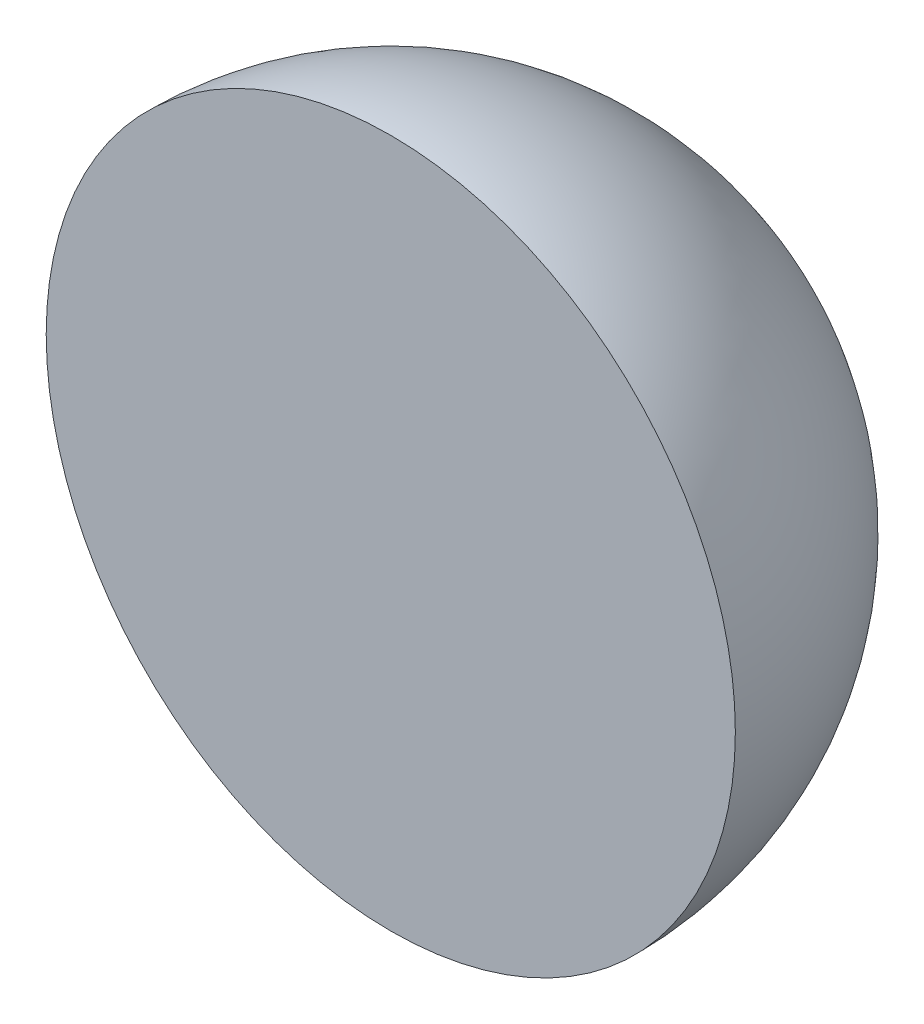
ISO-10303-21;
HEADER;
FILE_DESCRIPTION(('STEP AP214'),'2;1');
FILE_NAME('part.step','',(''),(''),'','','');
FILE_SCHEMA(('AUTOMOTIVE_DESIGN { 1 0 10303 214 1 1 1 1 }'));
ENDSEC;
DATA;
#1=APPLICATION_CONTEXT('core data for automotive mechanical design processes');
#2=APPLICATION_PROTOCOL_DEFINITION('international standard','automotive_design',2000,#1);
#3=PRODUCT_CONTEXT('',#1,'mechanical');
#4=PRODUCT('Part','Part','',(#3));
#5=PRODUCT_RELATED_PRODUCT_CATEGORY('part','',(#4));
#6=PRODUCT_DEFINITION_FORMATION('','',#4);
#7=PRODUCT_DEFINITION_CONTEXT('part definition',#1,'design');
#8=PRODUCT_DEFINITION('design','',#6,#7);
#9=PRODUCT_DEFINITION_SHAPE('','',#8);
#10=(LENGTH_UNIT() NAMED_UNIT(*) SI_UNIT(.MILLI.,.METRE.));
#11=(NAMED_UNIT(*) PLANE_ANGLE_UNIT() SI_UNIT($,.RADIAN.));
#12=(NAMED_UNIT(*) SI_UNIT($,.STERADIAN.) SOLID_ANGLE_UNIT());
#13=UNCERTAINTY_MEASURE_WITH_UNIT(LENGTH_MEASURE(1.E-05),#10,'distance_accuracy_value','');
#14=(GEOMETRIC_REPRESENTATION_CONTEXT(3) GLOBAL_UNCERTAINTY_ASSIGNED_CONTEXT((#13)) GLOBAL_UNIT_ASSIGNED_CONTEXT((#10,
#11,#12)) REPRESENTATION_CONTEXT('',''));
#15=CARTESIAN_POINT('',(0.,0.,0.));
#16=DIRECTION('',(0.,0.,1.));
#17=DIRECTION('',(1.,0.,0.));
#18=AXIS2_PLACEMENT_3D('',#15,#16,#17);
#19=CARTESIAN_POINT('',(0.,0.,0.));
#20=DIRECTION('',(0.,0.,-1.));
#21=DIRECTION('',(-1.,0.,0.));
#22=AXIS2_PLACEMENT_3D('',#19,#20,#21);
#23=PLANE('',#22);
#24=CARTESIAN_POINT('',(0.,0.,0.));
#25=DIRECTION('',(0.,0.,1.));
#26=DIRECTION('',(1.,0.,0.));
#27=AXIS2_PLACEMENT_3D('',#24,#25,#26);
#28=CIRCLE('',#27,20.);
#29=CARTESIAN_POINT('',(20.,0.,0.));
#30=VERTEX_POINT('',#29);
#31=EDGE_CURVE('E10',#30,#30,#28,.T.);
#32=ORIENTED_EDGE('',*,*,#31,.T.);
#33=EDGE_LOOP('',(#32));
#34=FACE_BOUND('',#33,.T.);
#35=ADVANCED_FACE('F31',(#34),#23,.F.);
#36=CARTESIAN_POINT('',(0.,0.,0.));
#37=DIRECTION('',(0.,0.,1.));
#38=DIRECTION('',(-1.,0.,0.));
#39=AXIS2_PLACEMENT_3D('',#36,#37,#38);
#40=SPHERICAL_SURFACE('',#39,20.);
#41=ORIENTED_EDGE('',*,*,#31,.F.);
#42=EDGE_LOOP('',(#41));
#43=FACE_BOUND('',#42,.T.);
#44=ADVANCED_FACE('F39',(#43),#40,.T.);
#45=CLOSED_SHELL('',(#35,#44));
#46=MANIFOLD_SOLID_BREP('B2',#45);
#47=ADVANCED_BREP_SHAPE_REPRESENTATION('',(#18,#46),#14);
#48=SHAPE_DEFINITION_REPRESENTATION(#9,#47);
ENDSEC;
END-ISO-10303-21;
